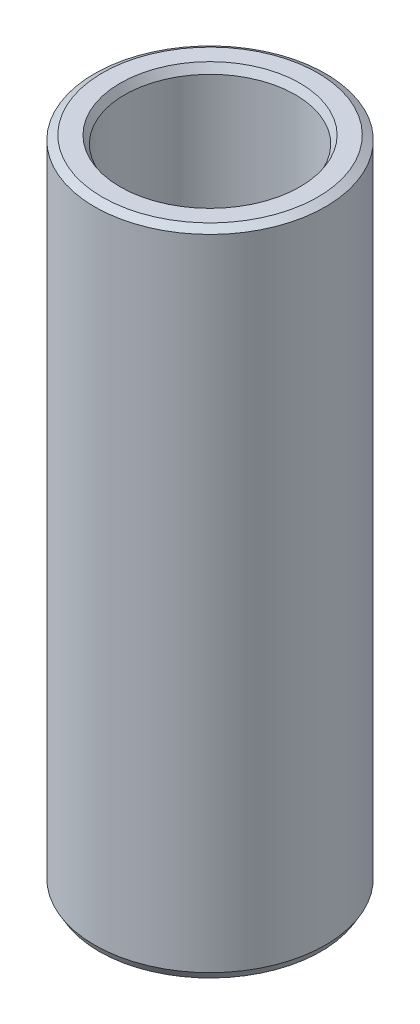
ISO-10303-21;
HEADER;
FILE_DESCRIPTION(('STEP AP214'),'2;1');
FILE_NAME('part.step','',(''),(''),'','','');
FILE_SCHEMA(('AUTOMOTIVE_DESIGN { 1 0 10303 214 1 1 1 1 }'));
ENDSEC;
DATA;
#1=APPLICATION_CONTEXT('core data for automotive mechanical design processes');
#2=APPLICATION_PROTOCOL_DEFINITION('international standard','automotive_design',2000,#1);
#3=PRODUCT_CONTEXT('',#1,'mechanical');
#4=PRODUCT('Part','Part','',(#3));
#5=PRODUCT_RELATED_PRODUCT_CATEGORY('part','',(#4));
#6=PRODUCT_DEFINITION_FORMATION('','',#4);
#7=PRODUCT_DEFINITION_CONTEXT('part definition',#1,'design');
#8=PRODUCT_DEFINITION('design','',#6,#7);
#9=PRODUCT_DEFINITION_SHAPE('','',#8);
#10=(LENGTH_UNIT() NAMED_UNIT(*) SI_UNIT(.MILLI.,.METRE.));
#11=(NAMED_UNIT(*) PLANE_ANGLE_UNIT() SI_UNIT($,.RADIAN.));
#12=(NAMED_UNIT(*) SI_UNIT($,.STERADIAN.) SOLID_ANGLE_UNIT());
#13=UNCERTAINTY_MEASURE_WITH_UNIT(LENGTH_MEASURE(1.E-05),#10,'distance_accuracy_value','');
#14=(GEOMETRIC_REPRESENTATION_CONTEXT(3) GLOBAL_UNCERTAINTY_ASSIGNED_CONTEXT((#13)) GLOBAL_UNIT_ASSIGNED_CONTEXT((#10,
#11,#12)) REPRESENTATION_CONTEXT('',''));
#15=CARTESIAN_POINT('',(0.,0.,0.));
#16=DIRECTION('',(0.,0.,1.));
#17=DIRECTION('',(1.,0.,0.));
#18=AXIS2_PLACEMENT_3D('',#15,#16,#17);
#19=CARTESIAN_POINT('',(0.,310.442155114381,0.));
#20=DIRECTION('',(0.,-1.,0.));
#21=DIRECTION('',(0.,0.,-1.));
#22=AXIS2_PLACEMENT_3D('',#19,#20,#21);
#23=CYLINDRICAL_SURFACE('',#22,55.);
#24=CARTESIAN_POINT('',(0.,3.70903694468339,0.));
#25=DIRECTION('',(0.,1.,0.));
#26=DIRECTION('',(0.,0.,1.));
#27=AXIS2_PLACEMENT_3D('',#24,#25,#26);
#28=CIRCLE('',#27,55.);
#29=CARTESIAN_POINT('',(0.,3.70903694468339,55.));
#30=VERTEX_POINT('',#29);
#31=EDGE_CURVE('E10',#30,#30,#28,.T.);
#32=ORIENTED_EDGE('',*,*,#31,.T.);
#33=EDGE_LOOP('',(#32));
#34=FACE_BOUND('',#33,.T.);
#35=CARTESIAN_POINT('',(0.,308.300741635934,0.));
#36=DIRECTION('',(0.,1.,0.));
#37=DIRECTION('',(0.,0.,1.));
#38=AXIS2_PLACEMENT_3D('',#35,#36,#37);
#39=CIRCLE('',#38,55.);
#40=CARTESIAN_POINT('',(0.,308.300741635934,55.));
#41=VERTEX_POINT('',#40);
#42=EDGE_CURVE('E50',#41,#41,#39,.F.);
#43=ORIENTED_EDGE('',*,*,#42,.T.);
#44=EDGE_LOOP('',(#43));
#45=FACE_BOUND('',#44,.T.);
#46=ADVANCED_FACE('F39',(#34,#45),#23,.T.);
#47=CARTESIAN_POINT('',(0.,310.442155114381,0.));
#48=DIRECTION('',(0.,1.,0.));
#49=DIRECTION('',(0.,0.,1.));
#50=AXIS2_PLACEMENT_3D('',#47,#48,#49);
#51=PLANE('',#50);
#52=CARTESIAN_POINT('',(0.,310.442155114381,0.));
#53=DIRECTION('',(0.,1.,0.));
#54=DIRECTION('',(0.,0.,1.));
#55=AXIS2_PLACEMENT_3D('',#52,#53,#54);
#56=CIRCLE('',#55,42.8131397514442);
#57=CARTESIAN_POINT('',(0.,310.442155114381,42.8131397514442));
#58=VERTEX_POINT('',#57);
#59=EDGE_CURVE('E58',#58,#58,#56,.F.);
#60=ORIENTED_EDGE('',*,*,#59,.T.);
#61=EDGE_LOOP('',(#60));
#62=FACE_BOUND('',#61,.T.);
#63=CARTESIAN_POINT('',(0.,310.442155114381,0.));
#64=DIRECTION('',(0.,1.,0.));
#65=DIRECTION('',(0.,0.,1.));
#66=AXIS2_PLACEMENT_3D('',#63,#64,#65);
#67=CIRCLE('',#66,51.2909630553166);
#68=CARTESIAN_POINT('',(0.,310.442155114381,51.2909630553166));
#69=VERTEX_POINT('',#68);
#70=EDGE_CURVE('E61',#69,#69,#67,.T.);
#71=ORIENTED_EDGE('',*,*,#70,.T.);
#72=EDGE_LOOP('',(#71));
#73=FACE_BOUND('',#72,.T.);
#74=ADVANCED_FACE('F88',(#62,#73),#51,.T.);
#75=CARTESIAN_POINT('',(0.,0.,0.));
#76=DIRECTION('',(0.,1.,0.));
#77=DIRECTION('',(0.,0.,1.));
#78=AXIS2_PLACEMENT_3D('',#75,#76,#77);
#79=PLANE('',#78);
#80=CARTESIAN_POINT('',(0.,0.,0.));
#81=DIRECTION('',(0.,1.,0.));
#82=DIRECTION('',(0.,0.,1.));
#83=AXIS2_PLACEMENT_3D('',#80,#81,#82);
#84=CIRCLE('',#83,44.3807632176801);
#85=CARTESIAN_POINT('',(0.,0.,44.3807632176801));
#86=VERTEX_POINT('',#85);
#87=EDGE_CURVE('E51',#86,#86,#84,.T.);
#88=ORIENTED_EDGE('',*,*,#87,.T.);
#89=EDGE_LOOP('',(#88));
#90=FACE_BOUND('',#89,.T.);
#91=CARTESIAN_POINT('',(0.,0.,0.));
#92=DIRECTION('',(0.,1.,0.));
#93=DIRECTION('',(0.,0.,1.));
#94=AXIS2_PLACEMENT_3D('',#91,#92,#93);
#95=CIRCLE('',#94,52.8585865215528);
#96=CARTESIAN_POINT('',(0.,0.,52.8585865215528));
#97=VERTEX_POINT('',#96);
#98=EDGE_CURVE('E54',#97,#97,#95,.F.);
#99=ORIENTED_EDGE('',*,*,#98,.T.);
#100=EDGE_LOOP('',(#99));
#101=FACE_BOUND('',#100,.T.);
#102=ADVANCED_FACE('F83',(#90,#101),#79,.F.);
#103=CARTESIAN_POINT('',(0.,310.442155114381,0.));
#104=DIRECTION('',(0.,-1.,0.));
#105=DIRECTION('',(0.,0.,-1.));
#106=AXIS2_PLACEMENT_3D('',#103,#104,#105);
#107=CYLINDRICAL_SURFACE('',#106,40.6717262729969);
#108=CARTESIAN_POINT('',(0.,306.733118169697,0.));
#109=DIRECTION('',(0.,1.,0.));
#110=DIRECTION('',(0.,0.,1.));
#111=AXIS2_PLACEMENT_3D('',#108,#109,#110);
#112=CIRCLE('',#111,40.6717262729969);
#113=CARTESIAN_POINT('',(0.,306.733118169697,40.6717262729969));
#114=VERTEX_POINT('',#113);
#115=EDGE_CURVE('E67',#114,#114,#112,.T.);
#116=ORIENTED_EDGE('',*,*,#115,.T.);
#117=EDGE_LOOP('',(#116));
#118=FACE_BOUND('',#117,.T.);
#119=CARTESIAN_POINT('',(0.,2.14141347844721,0.));
#120=DIRECTION('',(0.,1.,0.));
#121=DIRECTION('',(0.,0.,1.));
#122=AXIS2_PLACEMENT_3D('',#119,#120,#121);
#123=CIRCLE('',#122,40.6717262729969);
#124=CARTESIAN_POINT('',(0.,2.14141347844721,40.6717262729969));
#125=VERTEX_POINT('',#124);
#126=EDGE_CURVE('E69',#125,#125,#123,.F.);
#127=ORIENTED_EDGE('',*,*,#126,.T.);
#128=EDGE_LOOP('',(#127));
#129=FACE_BOUND('',#128,.T.);
#130=ADVANCED_FACE('F71',(#118,#129),#107,.F.);
#131=CARTESIAN_POINT('',(0.,306.733118169697,0.));
#132=DIRECTION('',(0.,1.,0.));
#133=DIRECTION('',(0.,0.,1.));
#134=AXIS2_PLACEMENT_3D('',#131,#132,#133);
#135=CONICAL_SURFACE('',#134,40.6717262729969,0.523598775598304);
#136=CARTESIAN_POINT('',(0.,310.442155114381,42.8131397514442));
#137=CARTESIAN_POINT('',(0.,310.403519312874,42.7908333610437));
#138=CARTESIAN_POINT('',(0.,310.364883511367,42.7685269706432));
#139=CARTESIAN_POINT('',(0.,310.287611908352,42.7239141898422));
#140=CARTESIAN_POINT('',(0.,310.248976106845,42.7016077994417));
#141=CARTESIAN_POINT('',(0.,310.171704503831,42.6569950186407));
#142=CARTESIAN_POINT('',(0.,310.133068702324,42.6346886282402));
#143=CARTESIAN_POINT('',(0.,310.05579709931,42.5900758474392));
#144=CARTESIAN_POINT('',(0.,310.017161297803,42.5677694570388));
#145=CARTESIAN_POINT('',(0.,309.939889694788,42.5231566762378));
#146=CARTESIAN_POINT('',(0.,309.901253893281,42.5008502858373));
#147=CARTESIAN_POINT('',(0.,309.823982290267,42.4562375050363));
#148=CARTESIAN_POINT('',(0.,309.78534648876,42.4339311146358));
#149=CARTESIAN_POINT('',(0.,309.708074885746,42.3893183338348));
#150=CARTESIAN_POINT('',(0.,309.669439084239,42.3670119434343));
#151=CARTESIAN_POINT('',(0.,309.592167481224,42.3223991626333));
#152=CARTESIAN_POINT('',(0.,309.553531679717,42.3000927722328));
#153=CARTESIAN_POINT('',(0.,309.476260076703,42.2554799914319));
#154=CARTESIAN_POINT('',(0.,309.437624275196,42.2331736010313));
#155=CARTESIAN_POINT('',(0.,309.360352672182,42.1885608202304));
#156=CARTESIAN_POINT('',(0.,309.321716870674,42.1662544298299));
#157=CARTESIAN_POINT('',(0.,309.24444526766,42.1216416490289));
#158=CARTESIAN_POINT('',(0.,309.205809466153,42.0993352586284));
#159=CARTESIAN_POINT('',(0.,309.128537863139,42.0547224778274));
#160=CARTESIAN_POINT('',(0.,309.089902061632,42.0324160874269));
#161=CARTESIAN_POINT('',(0.,309.012630458618,41.9878033066259));
#162=CARTESIAN_POINT('',(0.,308.97399465711,41.9654969162254));
#163=CARTESIAN_POINT('',(0.,308.896723054096,41.9208841354245));
#164=CARTESIAN_POINT('',(0.,308.858087252589,41.898577745024));
#165=CARTESIAN_POINT('',(0.,308.780815649575,41.853964964223));
#166=CARTESIAN_POINT('',(0.,308.742179848068,41.8316585738225));
#167=CARTESIAN_POINT('',(0.,308.664908245053,41.7870457930215));
#168=CARTESIAN_POINT('',(0.,308.626272443546,41.764739402621));
#169=CARTESIAN_POINT('',(0.,308.549000840532,41.72012662182));
#170=CARTESIAN_POINT('',(0.,308.510365039025,41.6978202314195));
#171=CARTESIAN_POINT('',(0.,308.433093436011,41.6532074506185));
#172=CARTESIAN_POINT('',(0.,308.394457634504,41.6309010602181));
#173=CARTESIAN_POINT('',(0.,308.317186031489,41.5862882794171));
#174=CARTESIAN_POINT('',(0.,308.278550229982,41.5639818890166));
#175=CARTESIAN_POINT('',(0.,308.201278626968,41.5193691082156));
#176=CARTESIAN_POINT('',(0.,308.162642825461,41.4970627178151));
#177=CARTESIAN_POINT('',(0.,308.085371222447,41.4524499370141));
#178=CARTESIAN_POINT('',(0.,308.04673542094,41.4301435466136));
#179=CARTESIAN_POINT('',(0.,307.969463817925,41.3855307658126));
#180=CARTESIAN_POINT('',(0.,307.930828016418,41.3632243754121));
#181=CARTESIAN_POINT('',(0.,307.853556413404,41.3186115946111));
#182=CARTESIAN_POINT('',(0.,307.814920611897,41.2963052042107));
#183=CARTESIAN_POINT('',(0.,307.737649008883,41.2516924234097));
#184=CARTESIAN_POINT('',(0.,307.699013207375,41.2293860330092));
#185=CARTESIAN_POINT('',(0.,307.621741604361,41.1847732522082));
#186=CARTESIAN_POINT('',(0.,307.583105802854,41.1624668618077));
#187=CARTESIAN_POINT('',(0.,307.50583419984,41.1178540810067));
#188=CARTESIAN_POINT('',(0.,307.467198398333,41.0955476906062));
#189=CARTESIAN_POINT('',(0.,307.389926795319,41.0509349098052));
#190=CARTESIAN_POINT('',(0.,307.351290993811,41.0286285194047));
#191=CARTESIAN_POINT('',(0.,307.274019390797,40.9840157386038));
#192=CARTESIAN_POINT('',(0.,307.23538358929,40.9617093482033));
#193=CARTESIAN_POINT('',(0.,307.158111986276,40.9170965674023));
#194=CARTESIAN_POINT('',(0.,307.119476184769,40.8947901770018));
#195=CARTESIAN_POINT('',(0.,307.042204581754,40.8501773962008));
#196=CARTESIAN_POINT('',(0.,307.003568780247,40.8278710058003));
#197=CARTESIAN_POINT('',(0.,306.926297177233,40.7832582249993));
#198=CARTESIAN_POINT('',(0.,306.887661375726,40.7609518345988));
#199=CARTESIAN_POINT('',(0.,306.810389772712,40.7163390537978));
#200=CARTESIAN_POINT('',(0.,306.771753971205,40.6940326633973));
#201=CARTESIAN_POINT('',(0.,306.733118169697,40.6717262729969));
#202=B_SPLINE_CURVE_WITH_KNOTS('',3,(#136,#137,#138,#139,#140,#141,#142,#143,#144,#145,#146,
#147,#148,#149,#150,#151,#152,#153,#154,#155,#156,#157,#158,#159,#160,#161,#162,#163,#164,#165,
#166,#167,#168,#169,#170,#171,#172,#173,#174,#175,#176,#177,#178,#179,#180,#181,#182,#183,#184,
#185,#186,#187,#188,#189,#190,#191,#192,#193,#194,#195,#196,#197,#198,#199,#200,#201),
.UNSPECIFIED.,.F.,.F.,(4,2,2,2,2,2,2,2,2,2,2,2,2,2,2,2,2,2,2,2,2,2,2,2,2,2,2,2,2,2,2,2,4),(0.,
0.133838342402933,0.267676684805912,0.401515027208845,0.535353369611823,0.669191712014757,
0.803030054417735,0.936868396820668,1.07070673922365,1.20454508162658,1.33838342402956,
1.47222176643249,1.60606010883547,1.7398984512384,1.87373679364138,2.00757513604431,
2.14141347844729,2.27525182085022,2.4090901632532,2.54292850565614,2.67676684805912,
2.81060519046205,2.94444353286503,3.07828187526796,3.21212021767094,3.34595856007387,
3.47979690247685,3.61363524487978,3.74747358728276,3.88131192968569,4.01515027208867,
4.1489886144916,4.28282695689453),.UNSPECIFIED.);
#203=EDGE_CURVE('BSEAM77',#58,#114,#202,.T.);
#204=ORIENTED_EDGE('',*,*,#59,.F.);
#205=ORIENTED_EDGE('',*,*,#115,.F.);
#206=ORIENTED_EDGE('',*,*,#203,.T.);
#207=ORIENTED_EDGE('',*,*,#203,.F.);
#208=EDGE_LOOP('',(#204,#206,#205,#207));
#209=FACE_BOUND('',#208,.T.);
#210=ADVANCED_FACE('F77',(#209),#135,.F.);
#211=CARTESIAN_POINT('',(0.,0.,0.));
#212=DIRECTION('',(0.,-1.,0.));
#213=DIRECTION('',(0.,0.,-1.));
#214=AXIS2_PLACEMENT_3D('',#211,#212,#213);
#215=CONICAL_SURFACE('',#214,44.3807632176801,1.04719755119659);
#216=ORIENTED_EDGE('',*,*,#126,.F.);
#217=EDGE_LOOP('',(#216));
#218=FACE_BOUND('',#217,.T.);
#219=ORIENTED_EDGE('',*,*,#87,.F.);
#220=EDGE_LOOP('',(#219));
#221=FACE_BOUND('',#220,.T.);
#222=ADVANCED_FACE('F73',(#218,#221),#215,.F.);
#223=CARTESIAN_POINT('',(0.,3.70903694468339,0.));
#224=DIRECTION('',(0.,1.,0.));
#225=DIRECTION('',(0.,0.,1.));
#226=AXIS2_PLACEMENT_3D('',#223,#224,#225);
#227=CONICAL_SURFACE('',#226,55.,0.523598775598298);
#228=CARTESIAN_POINT('',(0.,0.,52.8585865215528));
#229=CARTESIAN_POINT('',(0.,0.0386358015071182,52.8808929119533));
#230=CARTESIAN_POINT('',(0.,0.0772716030142368,52.9031993023538));
#231=CARTESIAN_POINT('',(0.,0.154543206028474,52.9478120831548));
#232=CARTESIAN_POINT('',(0.,0.193179007535593,52.9701184735552));
#233=CARTESIAN_POINT('',(0.,0.27045061054983,53.0147312543562));
#234=CARTESIAN_POINT('',(0.,0.309086412056948,53.0370376447567));
#235=CARTESIAN_POINT('',(0.,0.386358015071186,53.0816504255577));
#236=CARTESIAN_POINT('',(0.,0.424993816578304,53.1039568159582));
#237=CARTESIAN_POINT('',(0.,0.502265419592541,53.1485695967592));
#238=CARTESIAN_POINT('',(0.,0.54090122109966,53.1708759871597));
#239=CARTESIAN_POINT('',(0.,0.618172824113897,53.2154887679607));
#240=CARTESIAN_POINT('',(0.,0.656808625621016,53.2377951583611));
#241=CARTESIAN_POINT('',(0.,0.734080228635253,53.2824079391621));
#242=CARTESIAN_POINT('',(0.,0.772716030142372,53.3047143295626));
#243=CARTESIAN_POINT('',(0.,0.849987633156609,53.3493271103636));
#244=CARTESIAN_POINT('',(0.,0.888623434663728,53.3716335007641));
#245=CARTESIAN_POINT('',(0.,0.965895037677965,53.4162462815651));
#246=CARTESIAN_POINT('',(0.,1.00453083918508,53.4385526719656));
#247=CARTESIAN_POINT('',(0.,1.08180244219932,53.4831654527665));
#248=CARTESIAN_POINT('',(0.,1.12043824370644,53.5054718431671));
#249=CARTESIAN_POINT('',(0.,1.19770984672068,53.550084623968));
#250=CARTESIAN_POINT('',(0.,1.23634564822779,53.5723910143685));
#251=CARTESIAN_POINT('',(0.,1.31361725124203,53.6170037951695));
#252=CARTESIAN_POINT('',(0.,1.35225305274915,53.63931018557));
#253=CARTESIAN_POINT('',(0.,1.42952465576339,53.683922966371));
#254=CARTESIAN_POINT('',(0.,1.46816045727051,53.7062293567715));
#255=CARTESIAN_POINT('',(0.,1.54543206028474,53.7508421375725));
#256=CARTESIAN_POINT('',(0.,1.58406786179186,53.7731485279729));
#257=CARTESIAN_POINT('',(0.,1.6613394648061,53.8177613087739));
#258=CARTESIAN_POINT('',(0.,1.69997526631322,53.8400676991744));
#259=CARTESIAN_POINT('',(0.,1.77724686932746,53.8846804799754));
#260=CARTESIAN_POINT('',(0.,1.81588267083457,53.9069868703759));
#261=CARTESIAN_POINT('',(0.,1.89315427384881,53.9515996511769));
#262=CARTESIAN_POINT('',(0.,1.93179007535593,53.9739060415774));
#263=CARTESIAN_POINT('',(0.,2.00906167837017,54.0185188223784));
#264=CARTESIAN_POINT('',(0.,2.04769747987729,54.0408252127789));
#265=CARTESIAN_POINT('',(0.,2.12496908289152,54.0854379935798));
#266=CARTESIAN_POINT('',(0.,2.16360488439864,54.1077443839803));
#267=CARTESIAN_POINT('',(0.,2.24087648741288,54.1523571647813));
#268=CARTESIAN_POINT('',(0.,2.27951228892,54.1746635551818));
#269=CARTESIAN_POINT('',(0.,2.35678389193423,54.2192763359828));
#270=CARTESIAN_POINT('',(0.,2.39541969344135,54.2415827263833));
#271=CARTESIAN_POINT('',(0.,2.47269129645559,54.2861955071843));
#272=CARTESIAN_POINT('',(0.,2.51132709796271,54.3085018975848));
#273=CARTESIAN_POINT('',(0.,2.58859870097695,54.3531146783857));
#274=CARTESIAN_POINT('',(0.,2.62723450248407,54.3754210687862));
#275=CARTESIAN_POINT('',(0.,2.7045061054983,54.4200338495872));
#276=CARTESIAN_POINT('',(0.,2.74314190700542,54.4423402399877));
#277=CARTESIAN_POINT('',(0.,2.82041351001966,54.4869530207887));
#278=CARTESIAN_POINT('',(0.,2.85904931152678,54.5092594111892));
#279=CARTESIAN_POINT('',(0.,2.93632091454101,54.5538721919902));
#280=CARTESIAN_POINT('',(0.,2.97495671604813,54.5761785823907));
#281=CARTESIAN_POINT('',(0.,3.05222831906237,54.6207913631916));
#282=CARTESIAN_POINT('',(0.,3.09086412056949,54.6430977535921));
#283=CARTESIAN_POINT('',(0.,3.16813572358373,54.6877105343931));
#284=CARTESIAN_POINT('',(0.,3.20677152509084,54.7100169247936));
#285=CARTESIAN_POINT('',(0.,3.28404312810508,54.7546297055946));
#286=CARTESIAN_POINT('',(0.,3.3226789296122,54.7769360959951));
#287=CARTESIAN_POINT('',(0.,3.39995053262644,54.8215488767961));
#288=CARTESIAN_POINT('',(0.,3.43858633413356,54.8438552671966));
#289=CARTESIAN_POINT('',(0.,3.51585793714779,54.8884680479975));
#290=CARTESIAN_POINT('',(0.,3.55449373865491,54.910774438398));
#291=CARTESIAN_POINT('',(0.,3.63176534166915,54.955387219199));
#292=CARTESIAN_POINT('',(0.,3.67040114317627,54.9776936095995));
#293=CARTESIAN_POINT('',(0.,3.70903694468339,55.));
#294=B_SPLINE_CURVE_WITH_KNOTS('',3,(#228,#229,#230,#231,#232,#233,#234,#235,#236,#237,#238,
#239,#240,#241,#242,#243,#244,#245,#246,#247,#248,#249,#250,#251,#252,#253,#254,#255,#256,#257,
#258,#259,#260,#261,#262,#263,#264,#265,#266,#267,#268,#269,#270,#271,#272,#273,#274,#275,#276,
#277,#278,#279,#280,#281,#282,#283,#284,#285,#286,#287,#288,#289,#290,#291,#292,#293),
.UNSPECIFIED.,.F.,.F.,(4,2,2,2,2,2,2,2,2,2,2,2,2,2,2,2,2,2,2,2,2,2,2,2,2,2,2,2,2,2,2,2,4),(0.,
0.133838342402951,0.267676684805902,0.401515027208853,0.535353369611804,0.669191712014755,
0.803030054417706,0.936868396820657,1.07070673922361,1.20454508162656,1.33838342402951,
1.47222176643246,1.60606010883541,1.73989845123836,1.87373679364132,2.00757513604427,
2.14141347844722,2.27525182085017,2.40909016325312,2.54292850565607,2.67676684805902,
2.81060519046198,2.94444353286493,3.07828187526788,3.21212021767083,3.34595856007378,
3.47979690247673,3.61363524487968,3.74747358728263,3.88131192968558,4.01515027208853,
4.14898861449148,4.28282695689444),.UNSPECIFIED.);
#295=EDGE_CURVE('BSEAM76',#97,#30,#294,.T.);
#296=ORIENTED_EDGE('',*,*,#98,.F.);
#297=ORIENTED_EDGE('',*,*,#31,.F.);
#298=ORIENTED_EDGE('',*,*,#295,.T.);
#299=ORIENTED_EDGE('',*,*,#295,.F.);
#300=EDGE_LOOP('',(#296,#298,#297,#299));
#301=FACE_BOUND('',#300,.T.);
#302=ADVANCED_FACE('F76',(#301),#227,.T.);
#303=CARTESIAN_POINT('',(0.,310.442155114381,0.));
#304=DIRECTION('',(0.,-1.,0.));
#305=DIRECTION('',(0.,0.,-1.));
#306=AXIS2_PLACEMENT_3D('',#303,#304,#305);
#307=CONICAL_SURFACE('',#306,51.2909630553166,1.0471975511966);
#308=ORIENTED_EDGE('',*,*,#42,.F.);
#309=EDGE_LOOP('',(#308));
#310=FACE_BOUND('',#309,.T.);
#311=ORIENTED_EDGE('',*,*,#70,.F.);
#312=EDGE_LOOP('',(#311));
#313=FACE_BOUND('',#312,.T.);
#314=ADVANCED_FACE('F45',(#310,#313),#307,.T.);
#315=CLOSED_SHELL('',(#46,#74,#102,#130,#210,#222,#302,#314));
#316=MANIFOLD_SOLID_BREP('B2',#315);
#317=ADVANCED_BREP_SHAPE_REPRESENTATION('',(#18,#316),#14);
#318=SHAPE_DEFINITION_REPRESENTATION(#9,#317);
ENDSEC;
END-ISO-10303-21;
